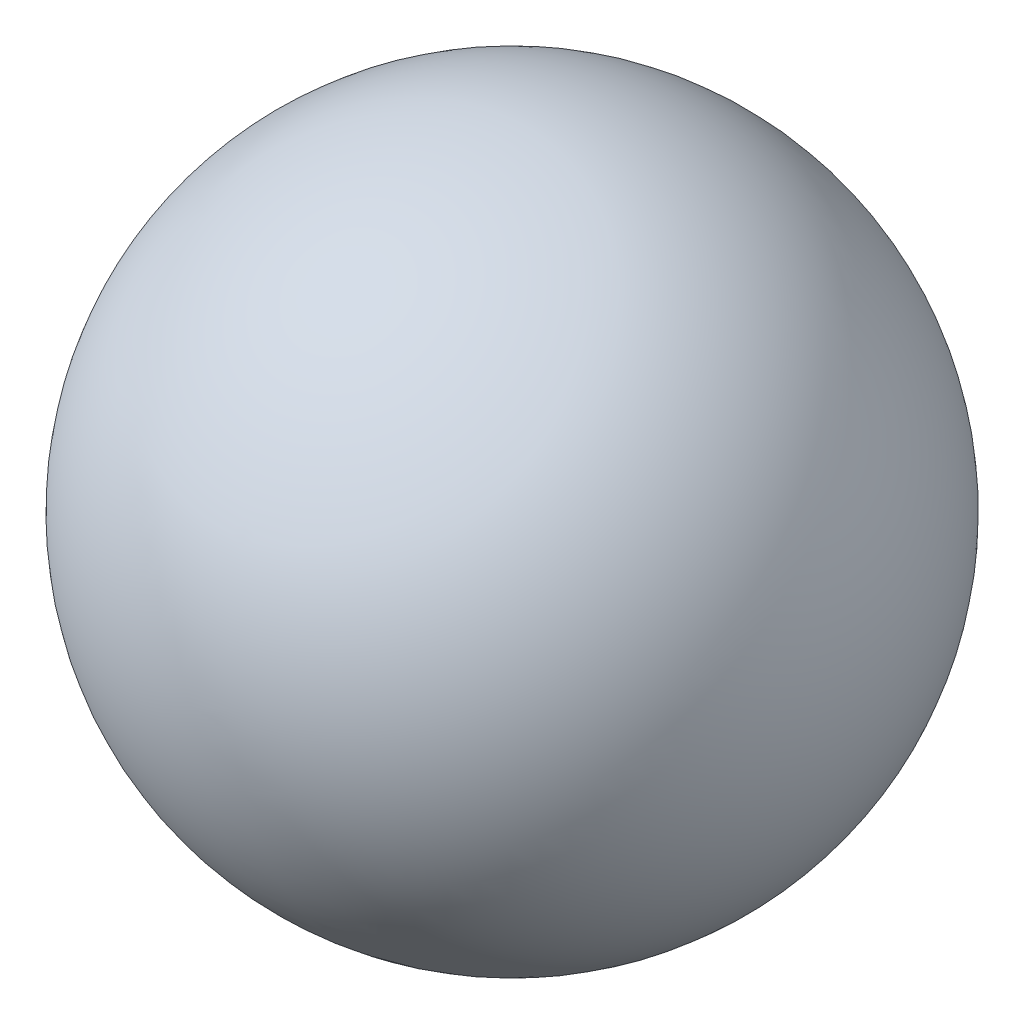
ISO-10303-21;
HEADER;
FILE_DESCRIPTION(('STEP AP214'),'2;1');
FILE_NAME('part.step','',(''),(''),'','','');
FILE_SCHEMA(('AUTOMOTIVE_DESIGN { 1 0 10303 214 1 1 1 1 }'));
ENDSEC;
DATA;
#1=APPLICATION_CONTEXT('core data for automotive mechanical design processes');
#2=APPLICATION_PROTOCOL_DEFINITION('international standard','automotive_design',2000,#1);
#3=PRODUCT_CONTEXT('',#1,'mechanical');
#4=PRODUCT('Part','Part','',(#3));
#5=PRODUCT_RELATED_PRODUCT_CATEGORY('part','',(#4));
#6=PRODUCT_DEFINITION_FORMATION('','',#4);
#7=PRODUCT_DEFINITION_CONTEXT('part definition',#1,'design');
#8=PRODUCT_DEFINITION('design','',#6,#7);
#9=PRODUCT_DEFINITION_SHAPE('','',#8);
#10=(LENGTH_UNIT() NAMED_UNIT(*) SI_UNIT(.MILLI.,.METRE.));
#11=(NAMED_UNIT(*) PLANE_ANGLE_UNIT() SI_UNIT($,.RADIAN.));
#12=(NAMED_UNIT(*) SI_UNIT($,.STERADIAN.) SOLID_ANGLE_UNIT());
#13=UNCERTAINTY_MEASURE_WITH_UNIT(LENGTH_MEASURE(1.E-05),#10,'distance_accuracy_value','');
#14=(GEOMETRIC_REPRESENTATION_CONTEXT(3) GLOBAL_UNCERTAINTY_ASSIGNED_CONTEXT((#13)) GLOBAL_UNIT_ASSIGNED_CONTEXT((#10,
#11,#12)) REPRESENTATION_CONTEXT('',''));
#15=CARTESIAN_POINT('',(0.,0.,0.));
#16=DIRECTION('',(0.,0.,1.));
#17=DIRECTION('',(1.,0.,0.));
#18=AXIS2_PLACEMENT_3D('',#15,#16,#17);
#19=CARTESIAN_POINT('',(57.535,49.9578164363493,35.921331673005));
#20=DIRECTION('',(0.,0.811906363998105,0.583787680667704));
#21=DIRECTION('',(0.173648177666933,-0.57491863403457,0.799571681985285));
#22=AXIS2_PLACEMENT_3D('',#19,#20,#21);
#23=SPHERICAL_SURFACE('',#22,6.75);
#24=CARTESIAN_POINT('',(57.535,44.4774484793621,31.980764828498));
#25=VERTEX_POINT('',#24);
#26=VERTEX_LOOP('',#25);
#27=FACE_BOUND('',#26,.T.);
#28=CARTESIAN_POINT('',(57.535,55.4381843933365,39.861898517512));
#29=VERTEX_POINT('',#28);
#30=VERTEX_LOOP('',#29);
#31=FACE_BOUND('',#30,.T.);
#32=ADVANCED_FACE('F16',(#27,#31),#23,.T.);
#33=CLOSED_SHELL('',(#32));
#34=MANIFOLD_SOLID_BREP('B1',#33);
#35=ADVANCED_BREP_SHAPE_REPRESENTATION('',(#18,#34),#14);
#36=SHAPE_DEFINITION_REPRESENTATION(#9,#35);
ENDSEC;
END-ISO-10303-21;
